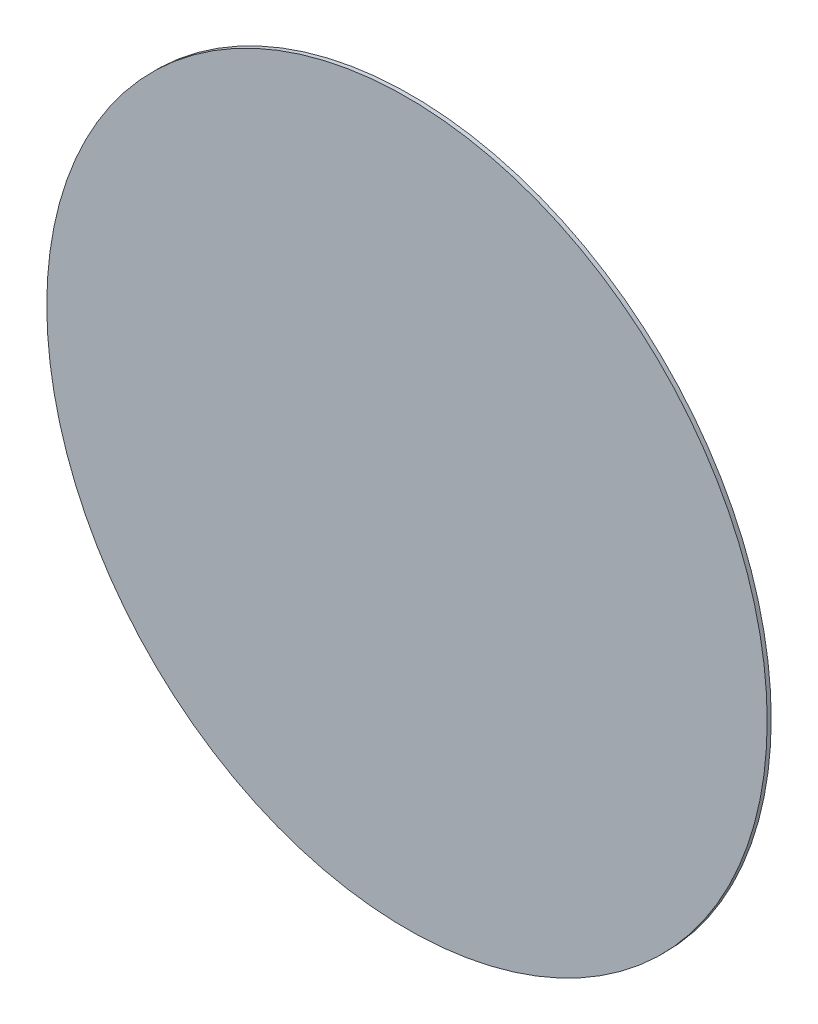
ISO-10303-21;
HEADER;
FILE_DESCRIPTION(('STEP AP214'),'2;1');
FILE_NAME('part.step','',(''),(''),'','','');
FILE_SCHEMA(('AUTOMOTIVE_DESIGN { 1 0 10303 214 1 1 1 1 }'));
ENDSEC;
DATA;
#1=APPLICATION_CONTEXT('core data for automotive mechanical design processes');
#2=APPLICATION_PROTOCOL_DEFINITION('international standard','automotive_design',2000,#1);
#3=PRODUCT_CONTEXT('',#1,'mechanical');
#4=PRODUCT('Part','Part','',(#3));
#5=PRODUCT_RELATED_PRODUCT_CATEGORY('part','',(#4));
#6=PRODUCT_DEFINITION_FORMATION('','',#4);
#7=PRODUCT_DEFINITION_CONTEXT('part definition',#1,'design');
#8=PRODUCT_DEFINITION('design','',#6,#7);
#9=PRODUCT_DEFINITION_SHAPE('','',#8);
#10=(LENGTH_UNIT() NAMED_UNIT(*) SI_UNIT(.MILLI.,.METRE.));
#11=(NAMED_UNIT(*) PLANE_ANGLE_UNIT() SI_UNIT($,.RADIAN.));
#12=(NAMED_UNIT(*) SI_UNIT($,.STERADIAN.) SOLID_ANGLE_UNIT());
#13=UNCERTAINTY_MEASURE_WITH_UNIT(LENGTH_MEASURE(1.E-05),#10,'distance_accuracy_value','');
#14=(GEOMETRIC_REPRESENTATION_CONTEXT(3) GLOBAL_UNCERTAINTY_ASSIGNED_CONTEXT((#13)) GLOBAL_UNIT_ASSIGNED_CONTEXT((#10,
#11,#12)) REPRESENTATION_CONTEXT('',''));
#15=CARTESIAN_POINT('',(0.,0.,0.));
#16=DIRECTION('',(0.,0.,1.));
#17=DIRECTION('',(1.,0.,0.));
#18=AXIS2_PLACEMENT_3D('',#15,#16,#17);
#19=CARTESIAN_POINT('',(0.,0.,0.09921875));
#20=DIRECTION('',(0.,0.,-1.));
#21=DIRECTION('',(-1.,0.,0.));
#22=AXIS2_PLACEMENT_3D('',#19,#20,#21);
#23=CYLINDRICAL_SURFACE('',#22,8.89);
#24=CARTESIAN_POINT('',(0.,0.,0.09921875));
#25=DIRECTION('',(0.,0.,1.));
#26=DIRECTION('',(1.,0.,0.));
#27=AXIS2_PLACEMENT_3D('',#24,#25,#26);
#28=CIRCLE('',#27,8.89);
#29=CARTESIAN_POINT('',(8.89,0.,0.09921875));
#30=VERTEX_POINT('',#29);
#31=EDGE_CURVE('E10',#30,#30,#28,.T.);
#32=ORIENTED_EDGE('',*,*,#31,.F.);
#33=EDGE_LOOP('',(#32));
#34=FACE_BOUND('',#33,.T.);
#35=CARTESIAN_POINT('',(0.,0.,0.));
#36=DIRECTION('',(0.,0.,1.));
#37=DIRECTION('',(1.,0.,0.));
#38=AXIS2_PLACEMENT_3D('',#35,#36,#37);
#39=CIRCLE('',#38,8.89);
#40=CARTESIAN_POINT('',(8.89,0.,0.));
#41=VERTEX_POINT('',#40);
#42=EDGE_CURVE('E36',#41,#41,#39,.T.);
#43=ORIENTED_EDGE('',*,*,#42,.T.);
#44=EDGE_LOOP('',(#43));
#45=FACE_BOUND('',#44,.T.);
#46=ADVANCED_FACE('F33',(#34,#45),#23,.T.);
#47=CARTESIAN_POINT('',(0.,0.,0.09921875));
#48=DIRECTION('',(0.,0.,1.));
#49=DIRECTION('',(1.,0.,0.));
#50=AXIS2_PLACEMENT_3D('',#47,#48,#49);
#51=PLANE('',#50);
#52=ORIENTED_EDGE('',*,*,#31,.T.);
#53=EDGE_LOOP('',(#52));
#54=FACE_BOUND('',#53,.T.);
#55=ADVANCED_FACE('F48',(#54),#51,.T.);
#56=CARTESIAN_POINT('',(0.,0.,0.));
#57=DIRECTION('',(0.,0.,1.));
#58=DIRECTION('',(1.,0.,0.));
#59=AXIS2_PLACEMENT_3D('',#56,#57,#58);
#60=PLANE('',#59);
#61=ORIENTED_EDGE('',*,*,#42,.F.);
#62=EDGE_LOOP('',(#61));
#63=FACE_BOUND('',#62,.T.);
#64=ADVANCED_FACE('F46',(#63),#60,.F.);
#65=CLOSED_SHELL('',(#46,#55,#64));
#66=MANIFOLD_SOLID_BREP('B2',#65);
#67=ADVANCED_BREP_SHAPE_REPRESENTATION('',(#18,#66),#14);
#68=SHAPE_DEFINITION_REPRESENTATION(#9,#67);
ENDSEC;
END-ISO-10303-21;
